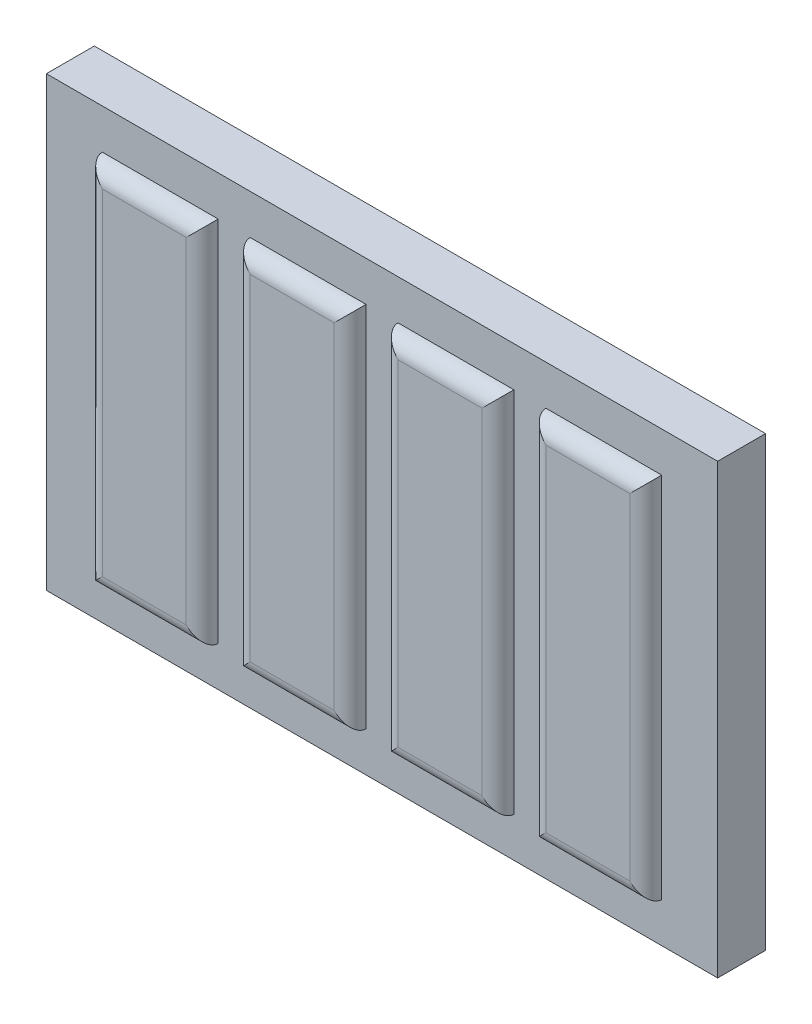
ISO-10303-21;
HEADER;
FILE_DESCRIPTION(('STEP AP214'),'2;1');
FILE_NAME('part.step','',(''),(''),'','','');
FILE_SCHEMA(('AUTOMOTIVE_DESIGN { 1 0 10303 214 1 1 1 1 }'));
ENDSEC;
DATA;
#1=APPLICATION_CONTEXT('core data for automotive mechanical design processes');
#2=APPLICATION_PROTOCOL_DEFINITION('international standard','automotive_design',2000,#1);
#3=PRODUCT_CONTEXT('',#1,'mechanical');
#4=PRODUCT('Part','Part','',(#3));
#5=PRODUCT_RELATED_PRODUCT_CATEGORY('part','',(#4));
#6=PRODUCT_DEFINITION_FORMATION('','',#4);
#7=PRODUCT_DEFINITION_CONTEXT('part definition',#1,'design');
#8=PRODUCT_DEFINITION('design','',#6,#7);
#9=PRODUCT_DEFINITION_SHAPE('','',#8);
#10=(LENGTH_UNIT() NAMED_UNIT(*) SI_UNIT(.MILLI.,.METRE.));
#11=(NAMED_UNIT(*) PLANE_ANGLE_UNIT() SI_UNIT($,.RADIAN.));
#12=(NAMED_UNIT(*) SI_UNIT($,.STERADIAN.) SOLID_ANGLE_UNIT());
#13=UNCERTAINTY_MEASURE_WITH_UNIT(LENGTH_MEASURE(1.E-05),#10,'distance_accuracy_value','');
#14=(GEOMETRIC_REPRESENTATION_CONTEXT(3) GLOBAL_UNCERTAINTY_ASSIGNED_CONTEXT((#13)) GLOBAL_UNIT_ASSIGNED_CONTEXT((#10,
#11,#12)) REPRESENTATION_CONTEXT('',''));
#15=CARTESIAN_POINT('',(0.,0.,0.));
#16=DIRECTION('',(0.,0.,1.));
#17=DIRECTION('',(1.,0.,0.));
#18=AXIS2_PLACEMENT_3D('',#15,#16,#17);
#19=CARTESIAN_POINT('',(0.,0.,0.762));
#20=DIRECTION('',(0.,0.,1.));
#21=DIRECTION('',(1.,0.,0.));
#22=AXIS2_PLACEMENT_3D('',#19,#20,#21);
#23=PLANE('',#22);
#24=DIRECTION('',(0.,-1.,0.));
#25=VECTOR('',#24,1.);
#26=CARTESIAN_POINT('',(0.,7.112,0.762));
#27=LINE('',#26,#25);
#28=CARTESIAN_POINT('',(0.,7.112,0.762));
#29=VERTEX_POINT('',#28);
#30=CARTESIAN_POINT('',(0.,0.,0.762));
#31=VERTEX_POINT('',#30);
#32=EDGE_CURVE('E259',#29,#31,#27,.T.);
#33=ORIENTED_EDGE('',*,*,#32,.T.);
#34=DIRECTION('',(1.,0.,0.));
#35=VECTOR('',#34,1.);
#36=CARTESIAN_POINT('',(0.,0.,0.762));
#37=LINE('',#36,#35);
#38=CARTESIAN_POINT('',(10.668,0.,0.762));
#39=VERTEX_POINT('',#38);
#40=EDGE_CURVE('E263',#31,#39,#37,.T.);
#41=ORIENTED_EDGE('',*,*,#40,.T.);
#42=DIRECTION('',(0.,1.,0.));
#43=VECTOR('',#42,1.);
#44=CARTESIAN_POINT('',(10.668,0.,0.762));
#45=LINE('',#44,#43);
#46=CARTESIAN_POINT('',(10.668,7.112,0.762));
#47=VERTEX_POINT('',#46);
#48=EDGE_CURVE('E267',#39,#47,#45,.T.);
#49=ORIENTED_EDGE('',*,*,#48,.T.);
#50=DIRECTION('',(-1.,0.,0.));
#51=VECTOR('',#50,1.);
#52=CARTESIAN_POINT('',(10.668,7.112,0.762));
#53=LINE('',#52,#51);
#54=EDGE_CURVE('E270',#47,#29,#53,.T.);
#55=ORIENTED_EDGE('',*,*,#54,.T.);
#56=EDGE_LOOP('',(#33,#41,#49,#55));
#57=FACE_BOUND('',#56,.T.);
#58=DIRECTION('',(0.,-1.,0.));
#59=VECTOR('',#58,1.);
#60=CARTESIAN_POINT('',(0.888999999999997,0.634999999999997,0.762));
#61=LINE('',#60,#59);
#62=CARTESIAN_POINT('',(0.888999999999997,6.477,0.762));
#63=VERTEX_POINT('',#62);
#64=CARTESIAN_POINT('',(0.888999999999997,0.634999999999997,0.762));
#65=VERTEX_POINT('',#64);
#66=EDGE_CURVE('E246',#63,#65,#61,.T.);
#67=ORIENTED_EDGE('',*,*,#66,.F.);
#68=DIRECTION('',(-1.,0.,0.));
#69=VECTOR('',#68,1.);
#70=CARTESIAN_POINT('',(0.888999999999997,6.477,0.762));
#71=LINE('',#70,#69);
#72=CARTESIAN_POINT('',(2.7305,6.477,0.762));
#73=VERTEX_POINT('',#72);
#74=EDGE_CURVE('E242',#73,#63,#71,.T.);
#75=ORIENTED_EDGE('',*,*,#74,.F.);
#76=DIRECTION('',(0.,1.,0.));
#77=VECTOR('',#76,1.);
#78=CARTESIAN_POINT('',(2.7305,6.477,0.762));
#79=LINE('',#78,#77);
#80=CARTESIAN_POINT('',(2.7305,0.634999999999998,0.762));
#81=VERTEX_POINT('',#80);
#82=EDGE_CURVE('E254',#81,#73,#79,.T.);
#83=ORIENTED_EDGE('',*,*,#82,.F.);
#84=DIRECTION('',(1.,0.,0.));
#85=VECTOR('',#84,1.);
#86=CARTESIAN_POINT('',(0.888999999999997,0.634999999999997,0.762));
#87=LINE('',#86,#85);
#88=EDGE_CURVE('E250',#65,#81,#87,.T.);
#89=ORIENTED_EDGE('',*,*,#88,.F.);
#90=EDGE_LOOP('',(#67,#75,#83,#89));
#91=FACE_BOUND('',#90,.T.);
#92=DIRECTION('',(0.,-1.,0.));
#93=VECTOR('',#92,1.);
#94=CARTESIAN_POINT('',(7.9375,6.477,0.762));
#95=LINE('',#94,#93);
#96=CARTESIAN_POINT('',(7.9375,6.477,0.762));
#97=VERTEX_POINT('',#96);
#98=CARTESIAN_POINT('',(7.9375,0.634999999999998,0.762));
#99=VERTEX_POINT('',#98);
#100=EDGE_CURVE('E230',#97,#99,#95,.T.);
#101=ORIENTED_EDGE('',*,*,#100,.F.);
#102=DIRECTION('',(-1.,0.,0.));
#103=VECTOR('',#102,1.);
#104=CARTESIAN_POINT('',(7.9375,6.477,0.762));
#105=LINE('',#104,#103);
#106=CARTESIAN_POINT('',(9.779,6.477,0.762));
#107=VERTEX_POINT('',#106);
#108=EDGE_CURVE('E226',#107,#97,#105,.T.);
#109=ORIENTED_EDGE('',*,*,#108,.F.);
#110=DIRECTION('',(0.,1.,0.));
#111=VECTOR('',#110,1.);
#112=CARTESIAN_POINT('',(9.779,6.477,0.762));
#113=LINE('',#112,#111);
#114=CARTESIAN_POINT('',(9.779,0.634999999999998,0.762));
#115=VERTEX_POINT('',#114);
#116=EDGE_CURVE('E238',#115,#107,#113,.T.);
#117=ORIENTED_EDGE('',*,*,#116,.F.);
#118=DIRECTION('',(1.,0.,0.));
#119=VECTOR('',#118,1.);
#120=CARTESIAN_POINT('',(7.9375,0.634999999999998,0.762));
#121=LINE('',#120,#119);
#122=EDGE_CURVE('E234',#99,#115,#121,.T.);
#123=ORIENTED_EDGE('',*,*,#122,.F.);
#124=EDGE_LOOP('',(#101,#109,#117,#123));
#125=FACE_BOUND('',#124,.T.);
#126=DIRECTION('',(0.,-1.,0.));
#127=VECTOR('',#126,1.);
#128=CARTESIAN_POINT('',(3.2385,6.477,0.762));
#129=LINE('',#128,#127);
#130=CARTESIAN_POINT('',(3.2385,6.477,0.762));
#131=VERTEX_POINT('',#130);
#132=CARTESIAN_POINT('',(3.2385,0.634999999999998,0.762));
#133=VERTEX_POINT('',#132);
#134=EDGE_CURVE('E214',#131,#133,#129,.T.);
#135=ORIENTED_EDGE('',*,*,#134,.F.);
#136=DIRECTION('',(-1.,0.,0.));
#137=VECTOR('',#136,1.);
#138=CARTESIAN_POINT('',(3.2385,6.477,0.762));
#139=LINE('',#138,#137);
#140=CARTESIAN_POINT('',(5.08,6.477,0.762));
#141=VERTEX_POINT('',#140);
#142=EDGE_CURVE('E210',#141,#131,#139,.T.);
#143=ORIENTED_EDGE('',*,*,#142,.F.);
#144=DIRECTION('',(0.,1.,0.));
#145=VECTOR('',#144,1.);
#146=CARTESIAN_POINT('',(5.08,6.477,0.762));
#147=LINE('',#146,#145);
#148=CARTESIAN_POINT('',(5.08,0.634999999999998,0.762));
#149=VERTEX_POINT('',#148);
#150=EDGE_CURVE('E222',#149,#141,#147,.T.);
#151=ORIENTED_EDGE('',*,*,#150,.F.);
#152=DIRECTION('',(1.,0.,0.));
#153=VECTOR('',#152,1.);
#154=CARTESIAN_POINT('',(3.2385,0.634999999999998,0.762));
#155=LINE('',#154,#153);
#156=EDGE_CURVE('E218',#133,#149,#155,.T.);
#157=ORIENTED_EDGE('',*,*,#156,.F.);
#158=EDGE_LOOP('',(#135,#143,#151,#157));
#159=FACE_BOUND('',#158,.T.);
#160=DIRECTION('',(0.,-1.,0.));
#161=VECTOR('',#160,1.);
#162=CARTESIAN_POINT('',(5.588,6.477,0.762));
#163=LINE('',#162,#161);
#164=CARTESIAN_POINT('',(5.588,6.477,0.762));
#165=VERTEX_POINT('',#164);
#166=CARTESIAN_POINT('',(5.588,0.634999999999998,0.762));
#167=VERTEX_POINT('',#166);
#168=EDGE_CURVE('E176',#165,#167,#163,.T.);
#169=ORIENTED_EDGE('',*,*,#168,.F.);
#170=DIRECTION('',(-1.,0.,0.));
#171=VECTOR('',#170,1.);
#172=CARTESIAN_POINT('',(5.588,6.477,0.762));
#173=LINE('',#172,#171);
#174=CARTESIAN_POINT('',(7.4295,6.477,0.762));
#175=VERTEX_POINT('',#174);
#176=EDGE_CURVE('E180',#175,#165,#173,.T.);
#177=ORIENTED_EDGE('',*,*,#176,.F.);
#178=DIRECTION('',(0.,1.,0.));
#179=VECTOR('',#178,1.);
#180=CARTESIAN_POINT('',(7.4295,6.477,0.762));
#181=LINE('',#180,#179);
#182=CARTESIAN_POINT('',(7.4295,0.634999999999998,0.762));
#183=VERTEX_POINT('',#182);
#184=EDGE_CURVE('E207',#183,#175,#181,.T.);
#185=ORIENTED_EDGE('',*,*,#184,.F.);
#186=DIRECTION('',(1.,0.,0.));
#187=VECTOR('',#186,1.);
#188=CARTESIAN_POINT('',(5.588,0.634999999999998,0.762));
#189=LINE('',#188,#187);
#190=EDGE_CURVE('E183',#167,#183,#189,.T.);
#191=ORIENTED_EDGE('',*,*,#190,.F.);
#192=EDGE_LOOP('',(#169,#177,#185,#191));
#193=FACE_BOUND('',#192,.T.);
#194=ADVANCED_FACE('F39',(#57,#91,#125,#159,#193),#23,.T.);
#195=CARTESIAN_POINT('',(0.,7.112,0.762));
#196=DIRECTION('',(1.,0.,0.));
#197=DIRECTION('',(0.,1.,0.));
#198=AXIS2_PLACEMENT_3D('',#195,#196,#197);
#199=PLANE('',#198);
#200=DIRECTION('',(0.,-1.,0.));
#201=VECTOR('',#200,1.);
#202=CARTESIAN_POINT('',(0.,7.112,0.));
#203=LINE('',#202,#201);
#204=CARTESIAN_POINT('',(0.,7.112,0.));
#205=VERTEX_POINT('',#204);
#206=CARTESIAN_POINT('',(0.,0.,0.));
#207=VERTEX_POINT('',#206);
#208=EDGE_CURVE('E258',#205,#207,#203,.T.);
#209=ORIENTED_EDGE('',*,*,#208,.T.);
#210=DIRECTION('',(0.,0.,-1.));
#211=VECTOR('',#210,1.);
#212=CARTESIAN_POINT('',(0.,0.,0.762));
#213=LINE('',#212,#211);
#214=EDGE_CURVE('E296',#31,#207,#213,.T.);
#215=ORIENTED_EDGE('',*,*,#214,.F.);
#216=ORIENTED_EDGE('',*,*,#32,.F.);
#217=DIRECTION('',(0.,0.,-1.));
#218=VECTOR('',#217,1.);
#219=CARTESIAN_POINT('',(0.,7.112,0.762));
#220=LINE('',#219,#218);
#221=EDGE_CURVE('E273',#29,#205,#220,.T.);
#222=ORIENTED_EDGE('',*,*,#221,.T.);
#223=EDGE_LOOP('',(#209,#215,#216,#222));
#224=FACE_BOUND('',#223,.T.);
#225=ADVANCED_FACE('F400',(#224),#199,.F.);
#226=CARTESIAN_POINT('',(0.,0.,0.762));
#227=DIRECTION('',(0.,1.,0.));
#228=DIRECTION('',(0.,0.,1.));
#229=AXIS2_PLACEMENT_3D('',#226,#227,#228);
#230=PLANE('',#229);
#231=DIRECTION('',(1.,0.,0.));
#232=VECTOR('',#231,1.);
#233=CARTESIAN_POINT('',(0.,0.,0.));
#234=LINE('',#233,#232);
#235=CARTESIAN_POINT('',(10.668,0.,0.));
#236=VERTEX_POINT('',#235);
#237=EDGE_CURVE('E277',#207,#236,#234,.T.);
#238=ORIENTED_EDGE('',*,*,#237,.T.);
#239=DIRECTION('',(0.,0.,-1.));
#240=VECTOR('',#239,1.);
#241=CARTESIAN_POINT('',(10.668,0.,0.762));
#242=LINE('',#241,#240);
#243=EDGE_CURVE('E292',#39,#236,#242,.T.);
#244=ORIENTED_EDGE('',*,*,#243,.F.);
#245=ORIENTED_EDGE('',*,*,#40,.F.);
#246=ORIENTED_EDGE('',*,*,#214,.T.);
#247=EDGE_LOOP('',(#238,#244,#245,#246));
#248=FACE_BOUND('',#247,.T.);
#249=ADVANCED_FACE('F406',(#248),#230,.F.);
#250=CARTESIAN_POINT('',(10.668,0.,0.762));
#251=DIRECTION('',(-1.,0.,0.));
#252=DIRECTION('',(0.,-1.,0.));
#253=AXIS2_PLACEMENT_3D('',#250,#251,#252);
#254=PLANE('',#253);
#255=DIRECTION('',(0.,1.,0.));
#256=VECTOR('',#255,1.);
#257=CARTESIAN_POINT('',(10.668,0.,0.));
#258=LINE('',#257,#256);
#259=CARTESIAN_POINT('',(10.668,7.112,0.));
#260=VERTEX_POINT('',#259);
#261=EDGE_CURVE('E280',#236,#260,#258,.T.);
#262=ORIENTED_EDGE('',*,*,#261,.T.);
#263=DIRECTION('',(0.,0.,-1.));
#264=VECTOR('',#263,1.);
#265=CARTESIAN_POINT('',(10.668,7.112,0.762));
#266=LINE('',#265,#264);
#267=EDGE_CURVE('E288',#47,#260,#266,.T.);
#268=ORIENTED_EDGE('',*,*,#267,.F.);
#269=ORIENTED_EDGE('',*,*,#48,.F.);
#270=ORIENTED_EDGE('',*,*,#243,.T.);
#271=EDGE_LOOP('',(#262,#268,#269,#270));
#272=FACE_BOUND('',#271,.T.);
#273=ADVANCED_FACE('F421',(#272),#254,.F.);
#274=CARTESIAN_POINT('',(10.668,7.112,0.762));
#275=DIRECTION('',(0.,-1.,0.));
#276=DIRECTION('',(1.,0.,0.));
#277=AXIS2_PLACEMENT_3D('',#274,#275,#276);
#278=PLANE('',#277);
#279=DIRECTION('',(-1.,0.,0.));
#280=VECTOR('',#279,1.);
#281=CARTESIAN_POINT('',(10.668,7.112,0.));
#282=LINE('',#281,#280);
#283=EDGE_CURVE('E264',#260,#205,#282,.T.);
#284=ORIENTED_EDGE('',*,*,#283,.T.);
#285=ORIENTED_EDGE('',*,*,#221,.F.);
#286=ORIENTED_EDGE('',*,*,#54,.F.);
#287=ORIENTED_EDGE('',*,*,#267,.T.);
#288=EDGE_LOOP('',(#284,#285,#286,#287));
#289=FACE_BOUND('',#288,.T.);
#290=ADVANCED_FACE('F417',(#289),#278,.F.);
#291=CARTESIAN_POINT('',(0.,0.,0.));
#292=DIRECTION('',(0.,0.,1.));
#293=DIRECTION('',(1.,0.,0.));
#294=AXIS2_PLACEMENT_3D('',#291,#292,#293);
#295=PLANE('',#294);
#296=ORIENTED_EDGE('',*,*,#208,.F.);
#297=ORIENTED_EDGE('',*,*,#283,.F.);
#298=ORIENTED_EDGE('',*,*,#261,.F.);
#299=ORIENTED_EDGE('',*,*,#237,.F.);
#300=EDGE_LOOP('',(#296,#297,#298,#299));
#301=FACE_BOUND('',#300,.T.);
#302=ADVANCED_FACE('F414',(#301),#295,.F.);
#303=CARTESIAN_POINT('',(0.,0.,1.016));
#304=DIRECTION('',(0.,0.,-1.));
#305=DIRECTION('',(-1.,0.,0.));
#306=AXIS2_PLACEMENT_3D('',#303,#304,#305);
#307=PLANE('',#306);
#308=DIRECTION('',(1.,0.,0.));
#309=VECTOR('',#308,1.);
#310=CARTESIAN_POINT('',(0.,0.888999999999997,1.016));
#311=LINE('',#310,#309);
#312=CARTESIAN_POINT('',(1.143,0.888999999999997,1.016));
#313=VERTEX_POINT('',#312);
#314=CARTESIAN_POINT('',(2.4765,0.888999999999998,1.016));
#315=VERTEX_POINT('',#314);
#316=EDGE_CURVE('E306',#313,#315,#311,.T.);
#317=ORIENTED_EDGE('',*,*,#316,.T.);
#318=DIRECTION('',(0.,1.,0.));
#319=VECTOR('',#318,1.);
#320=CARTESIAN_POINT('',(2.4765,0.,1.016));
#321=LINE('',#320,#319);
#322=CARTESIAN_POINT('',(2.4765,6.223,1.016));
#323=VERTEX_POINT('',#322);
#324=EDGE_CURVE('E309',#315,#323,#321,.T.);
#325=ORIENTED_EDGE('',*,*,#324,.T.);
#326=DIRECTION('',(-1.,0.,0.));
#327=VECTOR('',#326,1.);
#328=CARTESIAN_POINT('',(0.,6.223,1.016));
#329=LINE('',#328,#327);
#330=CARTESIAN_POINT('',(1.143,6.223,1.016));
#331=VERTEX_POINT('',#330);
#332=EDGE_CURVE('E300',#323,#331,#329,.T.);
#333=ORIENTED_EDGE('',*,*,#332,.T.);
#334=DIRECTION('',(0.,-1.,0.));
#335=VECTOR('',#334,1.);
#336=CARTESIAN_POINT('',(1.143,0.,1.016));
#337=LINE('',#336,#335);
#338=EDGE_CURVE('E303',#331,#313,#337,.T.);
#339=ORIENTED_EDGE('',*,*,#338,.T.);
#340=EDGE_LOOP('',(#317,#325,#333,#339));
#341=FACE_BOUND('',#340,.T.);
#342=ADVANCED_FACE('F412',(#341),#307,.F.);
#343=CARTESIAN_POINT('',(0.,0.,1.016));
#344=DIRECTION('',(0.,0.,-1.));
#345=DIRECTION('',(-1.,0.,0.));
#346=AXIS2_PLACEMENT_3D('',#343,#344,#345);
#347=PLANE('',#346);
#348=DIRECTION('',(1.,0.,0.));
#349=VECTOR('',#348,1.);
#350=CARTESIAN_POINT('',(0.,0.888999999999998,1.016));
#351=LINE('',#350,#349);
#352=CARTESIAN_POINT('',(8.1915,0.888999999999998,1.016));
#353=VERTEX_POINT('',#352);
#354=CARTESIAN_POINT('',(9.525,0.888999999999998,1.016));
#355=VERTEX_POINT('',#354);
#356=EDGE_CURVE('E332',#353,#355,#351,.T.);
#357=ORIENTED_EDGE('',*,*,#356,.T.);
#358=DIRECTION('',(0.,1.,0.));
#359=VECTOR('',#358,1.);
#360=CARTESIAN_POINT('',(9.525,0.,1.016));
#361=LINE('',#360,#359);
#362=CARTESIAN_POINT('',(9.525,6.223,1.016));
#363=VERTEX_POINT('',#362);
#364=EDGE_CURVE('E335',#355,#363,#361,.T.);
#365=ORIENTED_EDGE('',*,*,#364,.T.);
#366=DIRECTION('',(-1.,0.,0.));
#367=VECTOR('',#366,1.);
#368=CARTESIAN_POINT('',(0.,6.223,1.016));
#369=LINE('',#368,#367);
#370=CARTESIAN_POINT('',(8.1915,6.223,1.016));
#371=VERTEX_POINT('',#370);
#372=EDGE_CURVE('E326',#363,#371,#369,.T.);
#373=ORIENTED_EDGE('',*,*,#372,.T.);
#374=DIRECTION('',(0.,-1.,0.));
#375=VECTOR('',#374,1.);
#376=CARTESIAN_POINT('',(8.1915,0.,1.016));
#377=LINE('',#376,#375);
#378=EDGE_CURVE('E329',#371,#353,#377,.T.);
#379=ORIENTED_EDGE('',*,*,#378,.T.);
#380=EDGE_LOOP('',(#357,#365,#373,#379));
#381=FACE_BOUND('',#380,.T.);
#382=ADVANCED_FACE('F584',(#381),#347,.F.);
#383=CARTESIAN_POINT('',(0.,0.,1.016));
#384=DIRECTION('',(0.,0.,-1.));
#385=DIRECTION('',(-1.,0.,0.));
#386=AXIS2_PLACEMENT_3D('',#383,#384,#385);
#387=PLANE('',#386);
#388=DIRECTION('',(1.,0.,0.));
#389=VECTOR('',#388,1.);
#390=CARTESIAN_POINT('',(0.,0.888999999999998,1.016));
#391=LINE('',#390,#389);
#392=CARTESIAN_POINT('',(3.4925,0.888999999999998,1.016));
#393=VERTEX_POINT('',#392);
#394=CARTESIAN_POINT('',(4.826,0.888999999999998,1.016));
#395=VERTEX_POINT('',#394);
#396=EDGE_CURVE('E319',#393,#395,#391,.T.);
#397=ORIENTED_EDGE('',*,*,#396,.T.);
#398=DIRECTION('',(0.,1.,0.));
#399=VECTOR('',#398,1.);
#400=CARTESIAN_POINT('',(4.826,0.,1.016));
#401=LINE('',#400,#399);
#402=CARTESIAN_POINT('',(4.826,6.223,1.016));
#403=VERTEX_POINT('',#402);
#404=EDGE_CURVE('E322',#395,#403,#401,.T.);
#405=ORIENTED_EDGE('',*,*,#404,.T.);
#406=DIRECTION('',(-1.,0.,0.));
#407=VECTOR('',#406,1.);
#408=CARTESIAN_POINT('',(0.,6.223,1.016));
#409=LINE('',#408,#407);
#410=CARTESIAN_POINT('',(3.4925,6.223,1.016));
#411=VERTEX_POINT('',#410);
#412=EDGE_CURVE('E313',#403,#411,#409,.T.);
#413=ORIENTED_EDGE('',*,*,#412,.T.);
#414=DIRECTION('',(0.,-1.,0.));
#415=VECTOR('',#414,1.);
#416=CARTESIAN_POINT('',(3.4925,0.,1.016));
#417=LINE('',#416,#415);
#418=EDGE_CURVE('E316',#411,#393,#417,.T.);
#419=ORIENTED_EDGE('',*,*,#418,.T.);
#420=EDGE_LOOP('',(#397,#405,#413,#419));
#421=FACE_BOUND('',#420,.T.);
#422=ADVANCED_FACE('F575',(#421),#387,.F.);
#423=CARTESIAN_POINT('',(0.,0.,1.016));
#424=DIRECTION('',(0.,0.,-1.));
#425=DIRECTION('',(-1.,0.,0.));
#426=AXIS2_PLACEMENT_3D('',#423,#424,#425);
#427=PLANE('',#426);
#428=DIRECTION('',(1.,0.,0.));
#429=VECTOR('',#428,1.);
#430=CARTESIAN_POINT('',(0.,0.888999999999998,1.016));
#431=LINE('',#430,#429);
#432=CARTESIAN_POINT('',(5.842,0.888999999999998,1.016));
#433=VERTEX_POINT('',#432);
#434=CARTESIAN_POINT('',(7.1755,0.888999999999998,1.016));
#435=VERTEX_POINT('',#434);
#436=EDGE_CURVE('E49',#433,#435,#431,.T.);
#437=ORIENTED_EDGE('',*,*,#436,.T.);
#438=DIRECTION('',(0.,1.,0.));
#439=VECTOR('',#438,1.);
#440=CARTESIAN_POINT('',(7.1755,0.,1.016));
#441=LINE('',#440,#439);
#442=CARTESIAN_POINT('',(7.1755,6.223,1.016));
#443=VERTEX_POINT('',#442);
#444=EDGE_CURVE('E11',#435,#443,#441,.T.);
#445=ORIENTED_EDGE('',*,*,#444,.T.);
#446=DIRECTION('',(-1.,0.,0.));
#447=VECTOR('',#446,1.);
#448=CARTESIAN_POINT('',(0.,6.223,1.016));
#449=LINE('',#448,#447);
#450=CARTESIAN_POINT('',(5.842,6.223,1.016));
#451=VERTEX_POINT('',#450);
#452=EDGE_CURVE('E339',#443,#451,#449,.T.);
#453=ORIENTED_EDGE('',*,*,#452,.T.);
#454=DIRECTION('',(0.,-1.,0.));
#455=VECTOR('',#454,1.);
#456=CARTESIAN_POINT('',(5.842,0.,1.016));
#457=LINE('',#456,#455);
#458=EDGE_CURVE('E60',#451,#433,#457,.T.);
#459=ORIENTED_EDGE('',*,*,#458,.T.);
#460=EDGE_LOOP('',(#437,#445,#453,#459));
#461=FACE_BOUND('',#460,.T.);
#462=ADVANCED_FACE('F445',(#461),#427,.F.);
#463=CARTESIAN_POINT('',(1.143,0.,0.762));
#464=DIRECTION('',(0.,-1.,0.));
#465=DIRECTION('',(0.,0.,-1.));
#466=AXIS2_PLACEMENT_3D('',#463,#464,#465);
#467=CYLINDRICAL_SURFACE('',#466,0.254);
#468=CARTESIAN_POINT('',(1.143,6.223,0.762));
#469=DIRECTION('',(-0.707106781186547,-0.707106781186547,0.));
#470=DIRECTION('',(-0.707106781186547,0.707106781186547,0.));
#471=AXIS2_PLACEMENT_3D('',#468,#469,#470);
#472=ELLIPSE('',#471,0.359210244842766,0.254);
#473=EDGE_CURVE('E202',#63,#331,#472,.F.);
#474=ORIENTED_EDGE('',*,*,#473,.F.);
#475=ORIENTED_EDGE('',*,*,#66,.T.);
#476=CARTESIAN_POINT('',(1.143,0.888999999999997,0.762));
#477=DIRECTION('',(0.707106781186548,-0.707106781186547,0.));
#478=DIRECTION('',(-0.707106781186547,-0.707106781186548,0.));
#479=AXIS2_PLACEMENT_3D('',#476,#477,#478);
#480=ELLIPSE('',#479,0.359210244842766,0.254);
#481=EDGE_CURVE('E198',#313,#65,#480,.T.);
#482=ORIENTED_EDGE('',*,*,#481,.F.);
#483=ORIENTED_EDGE('',*,*,#338,.F.);
#484=EDGE_LOOP('',(#474,#475,#482,#483));
#485=FACE_BOUND('',#484,.T.);
#486=ADVANCED_FACE('F441',(#485),#467,.T.);
#487=CARTESIAN_POINT('',(0.,0.888999999999997,0.762));
#488=DIRECTION('',(1.,0.,0.));
#489=DIRECTION('',(0.,1.,0.));
#490=AXIS2_PLACEMENT_3D('',#487,#488,#489);
#491=CYLINDRICAL_SURFACE('',#490,0.254);
#492=ORIENTED_EDGE('',*,*,#481,.T.);
#493=ORIENTED_EDGE('',*,*,#88,.T.);
#494=CARTESIAN_POINT('',(2.4765,0.888999999999998,0.762));
#495=DIRECTION('',(0.707106781186547,0.707106781186548,0.));
#496=DIRECTION('',(0.707106781186548,-0.707106781186547,0.));
#497=AXIS2_PLACEMENT_3D('',#494,#495,#496);
#498=ELLIPSE('',#497,0.359210244842766,0.254);
#499=EDGE_CURVE('E349',#315,#81,#498,.T.);
#500=ORIENTED_EDGE('',*,*,#499,.F.);
#501=ORIENTED_EDGE('',*,*,#316,.F.);
#502=EDGE_LOOP('',(#492,#493,#500,#501));
#503=FACE_BOUND('',#502,.T.);
#504=ADVANCED_FACE('F437',(#503),#491,.T.);
#505=CARTESIAN_POINT('',(0.,6.223,0.762));
#506=DIRECTION('',(-1.,0.,0.));
#507=DIRECTION('',(0.,0.,1.));
#508=AXIS2_PLACEMENT_3D('',#505,#506,#507);
#509=CYLINDRICAL_SURFACE('',#508,0.254);
#510=ORIENTED_EDGE('',*,*,#473,.T.);
#511=ORIENTED_EDGE('',*,*,#332,.F.);
#512=CARTESIAN_POINT('',(2.4765,6.223,0.762));
#513=DIRECTION('',(-0.707106781186548,0.707106781186547,0.));
#514=DIRECTION('',(-0.707106781186547,-0.707106781186548,0.));
#515=AXIS2_PLACEMENT_3D('',#512,#513,#514);
#516=ELLIPSE('',#515,0.359210244842766,0.254);
#517=EDGE_CURVE('E346',#73,#323,#516,.F.);
#518=ORIENTED_EDGE('',*,*,#517,.F.);
#519=ORIENTED_EDGE('',*,*,#74,.T.);
#520=EDGE_LOOP('',(#510,#511,#518,#519));
#521=FACE_BOUND('',#520,.T.);
#522=ADVANCED_FACE('F433',(#521),#509,.T.);
#523=CARTESIAN_POINT('',(2.4765,0.,0.762));
#524=DIRECTION('',(0.,1.,0.));
#525=DIRECTION('',(-1.,0.,0.));
#526=AXIS2_PLACEMENT_3D('',#523,#524,#525);
#527=CYLINDRICAL_SURFACE('',#526,0.254);
#528=ORIENTED_EDGE('',*,*,#499,.T.);
#529=ORIENTED_EDGE('',*,*,#82,.T.);
#530=ORIENTED_EDGE('',*,*,#517,.T.);
#531=ORIENTED_EDGE('',*,*,#324,.F.);
#532=EDGE_LOOP('',(#528,#529,#530,#531));
#533=FACE_BOUND('',#532,.T.);
#534=ADVANCED_FACE('F429',(#533),#527,.T.);
#535=CARTESIAN_POINT('',(3.4925,0.,0.762));
#536=DIRECTION('',(0.,-1.,0.));
#537=DIRECTION('',(1.,0.,0.));
#538=AXIS2_PLACEMENT_3D('',#535,#536,#537);
#539=CYLINDRICAL_SURFACE('',#538,0.254);
#540=CARTESIAN_POINT('',(3.4925,6.223,0.762));
#541=DIRECTION('',(-0.707106781186547,-0.707106781186548,0.));
#542=DIRECTION('',(-0.707106781186548,0.707106781186547,0.));
#543=AXIS2_PLACEMENT_3D('',#540,#541,#542);
#544=ELLIPSE('',#543,0.359210244842766,0.254);
#545=EDGE_CURVE('E363',#131,#411,#544,.F.);
#546=ORIENTED_EDGE('',*,*,#545,.F.);
#547=ORIENTED_EDGE('',*,*,#134,.T.);
#548=CARTESIAN_POINT('',(3.4925,0.888999999999998,0.762));
#549=DIRECTION('',(0.707106781186548,-0.707106781186547,0.));
#550=DIRECTION('',(-0.707106781186547,-0.707106781186548,0.));
#551=AXIS2_PLACEMENT_3D('',#548,#549,#550);
#552=ELLIPSE('',#551,0.359210244842766,0.254);
#553=EDGE_CURVE('E350',#393,#133,#552,.T.);
#554=ORIENTED_EDGE('',*,*,#553,.F.);
#555=ORIENTED_EDGE('',*,*,#418,.F.);
#556=EDGE_LOOP('',(#546,#547,#554,#555));
#557=FACE_BOUND('',#556,.T.);
#558=ADVANCED_FACE('F432',(#557),#539,.T.);
#559=CARTESIAN_POINT('',(0.,0.888999999999998,0.762));
#560=DIRECTION('',(1.,0.,0.));
#561=DIRECTION('',(0.,0.,-1.));
#562=AXIS2_PLACEMENT_3D('',#559,#560,#561);
#563=CYLINDRICAL_SURFACE('',#562,0.254);
#564=ORIENTED_EDGE('',*,*,#553,.T.);
#565=ORIENTED_EDGE('',*,*,#156,.T.);
#566=CARTESIAN_POINT('',(4.826,0.888999999999998,0.762));
#567=DIRECTION('',(0.707106781186547,0.707106781186547,0.));
#568=DIRECTION('',(0.707106781186547,-0.707106781186547,0.));
#569=AXIS2_PLACEMENT_3D('',#566,#567,#568);
#570=ELLIPSE('',#569,0.359210244842766,0.254);
#571=EDGE_CURVE('E359',#395,#149,#570,.T.);
#572=ORIENTED_EDGE('',*,*,#571,.F.);
#573=ORIENTED_EDGE('',*,*,#396,.F.);
#574=EDGE_LOOP('',(#564,#565,#572,#573));
#575=FACE_BOUND('',#574,.T.);
#576=ADVANCED_FACE('F455',(#575),#563,.T.);
#577=CARTESIAN_POINT('',(0.,6.223,0.762));
#578=DIRECTION('',(-1.,0.,0.));
#579=DIRECTION('',(0.,0.,1.));
#580=AXIS2_PLACEMENT_3D('',#577,#578,#579);
#581=CYLINDRICAL_SURFACE('',#580,0.254);
#582=ORIENTED_EDGE('',*,*,#545,.T.);
#583=ORIENTED_EDGE('',*,*,#412,.F.);
#584=CARTESIAN_POINT('',(4.826,6.223,0.762));
#585=DIRECTION('',(-0.707106781186547,0.707106781186547,0.));
#586=DIRECTION('',(-0.707106781186547,-0.707106781186547,0.));
#587=AXIS2_PLACEMENT_3D('',#584,#585,#586);
#588=ELLIPSE('',#587,0.359210244842766,0.254);
#589=EDGE_CURVE('E356',#141,#403,#588,.F.);
#590=ORIENTED_EDGE('',*,*,#589,.F.);
#591=ORIENTED_EDGE('',*,*,#142,.T.);
#592=EDGE_LOOP('',(#582,#583,#590,#591));
#593=FACE_BOUND('',#592,.T.);
#594=ADVANCED_FACE('F451',(#593),#581,.T.);
#595=CARTESIAN_POINT('',(4.826,0.,0.762));
#596=DIRECTION('',(0.,1.,0.));
#597=DIRECTION('',(0.,0.,1.));
#598=AXIS2_PLACEMENT_3D('',#595,#596,#597);
#599=CYLINDRICAL_SURFACE('',#598,0.254);
#600=ORIENTED_EDGE('',*,*,#571,.T.);
#601=ORIENTED_EDGE('',*,*,#150,.T.);
#602=ORIENTED_EDGE('',*,*,#589,.T.);
#603=ORIENTED_EDGE('',*,*,#404,.F.);
#604=EDGE_LOOP('',(#600,#601,#602,#603));
#605=FACE_BOUND('',#604,.T.);
#606=ADVANCED_FACE('F447',(#605),#599,.T.);
#607=CARTESIAN_POINT('',(8.1915,0.,0.762));
#608=DIRECTION('',(0.,-1.,0.));
#609=DIRECTION('',(0.,0.,-1.));
#610=AXIS2_PLACEMENT_3D('',#607,#608,#609);
#611=CYLINDRICAL_SURFACE('',#610,0.254);
#612=CARTESIAN_POINT('',(8.1915,6.223,0.762));
#613=DIRECTION('',(-0.707106781186548,-0.707106781186547,0.));
#614=DIRECTION('',(-0.707106781186547,0.707106781186548,0.));
#615=AXIS2_PLACEMENT_3D('',#612,#613,#614);
#616=ELLIPSE('',#615,0.359210244842766,0.254);
#617=EDGE_CURVE('E376',#97,#371,#616,.F.);
#618=ORIENTED_EDGE('',*,*,#617,.F.);
#619=ORIENTED_EDGE('',*,*,#100,.T.);
#620=CARTESIAN_POINT('',(8.1915,0.888999999999998,0.762));
#621=DIRECTION('',(0.707106781186547,-0.707106781186547,0.));
#622=DIRECTION('',(-0.707106781186547,-0.707106781186547,0.));
#623=AXIS2_PLACEMENT_3D('',#620,#621,#622);
#624=ELLIPSE('',#623,0.359210244842766,0.254);
#625=EDGE_CURVE('E360',#353,#99,#624,.T.);
#626=ORIENTED_EDGE('',*,*,#625,.F.);
#627=ORIENTED_EDGE('',*,*,#378,.F.);
#628=EDGE_LOOP('',(#618,#619,#626,#627));
#629=FACE_BOUND('',#628,.T.);
#630=ADVANCED_FACE('F450',(#629),#611,.T.);
#631=CARTESIAN_POINT('',(0.,0.888999999999998,0.762));
#632=DIRECTION('',(1.,0.,0.));
#633=DIRECTION('',(0.,0.,-1.));
#634=AXIS2_PLACEMENT_3D('',#631,#632,#633);
#635=CYLINDRICAL_SURFACE('',#634,0.254);
#636=ORIENTED_EDGE('',*,*,#625,.T.);
#637=ORIENTED_EDGE('',*,*,#122,.T.);
#638=CARTESIAN_POINT('',(9.525,0.888999999999998,0.762));
#639=DIRECTION('',(0.707106781186547,0.707106781186548,0.));
#640=DIRECTION('',(0.707106781186548,-0.707106781186547,0.));
#641=AXIS2_PLACEMENT_3D('',#638,#639,#640);
#642=ELLIPSE('',#641,0.359210244842766,0.254);
#643=EDGE_CURVE('E373',#355,#115,#642,.T.);
#644=ORIENTED_EDGE('',*,*,#643,.F.);
#645=ORIENTED_EDGE('',*,*,#356,.F.);
#646=EDGE_LOOP('',(#636,#637,#644,#645));
#647=FACE_BOUND('',#646,.T.);
#648=ADVANCED_FACE('F469',(#647),#635,.T.);
#649=CARTESIAN_POINT('',(0.,6.223,0.762));
#650=DIRECTION('',(-1.,0.,0.));
#651=DIRECTION('',(0.,-1.,0.));
#652=AXIS2_PLACEMENT_3D('',#649,#650,#651);
#653=CYLINDRICAL_SURFACE('',#652,0.254);
#654=ORIENTED_EDGE('',*,*,#617,.T.);
#655=ORIENTED_EDGE('',*,*,#372,.F.);
#656=CARTESIAN_POINT('',(9.525,6.223,0.762));
#657=DIRECTION('',(-0.707106781186547,0.707106781186548,0.));
#658=DIRECTION('',(-0.707106781186548,-0.707106781186547,0.));
#659=AXIS2_PLACEMENT_3D('',#656,#657,#658);
#660=ELLIPSE('',#659,0.359210244842766,0.254);
#661=EDGE_CURVE('E370',#107,#363,#660,.F.);
#662=ORIENTED_EDGE('',*,*,#661,.F.);
#663=ORIENTED_EDGE('',*,*,#108,.T.);
#664=EDGE_LOOP('',(#654,#655,#662,#663));
#665=FACE_BOUND('',#664,.T.);
#666=ADVANCED_FACE('F465',(#665),#653,.T.);
#667=CARTESIAN_POINT('',(9.525,0.,0.762));
#668=DIRECTION('',(0.,1.,0.));
#669=DIRECTION('',(-1.,0.,0.));
#670=AXIS2_PLACEMENT_3D('',#667,#668,#669);
#671=CYLINDRICAL_SURFACE('',#670,0.254);
#672=ORIENTED_EDGE('',*,*,#643,.T.);
#673=ORIENTED_EDGE('',*,*,#116,.T.);
#674=ORIENTED_EDGE('',*,*,#661,.T.);
#675=ORIENTED_EDGE('',*,*,#364,.F.);
#676=EDGE_LOOP('',(#672,#673,#674,#675));
#677=FACE_BOUND('',#676,.T.);
#678=ADVANCED_FACE('F398',(#677),#671,.T.);
#679=CARTESIAN_POINT('',(5.842,0.,0.762));
#680=DIRECTION('',(0.,-1.,0.));
#681=DIRECTION('',(1.,0.,0.));
#682=AXIS2_PLACEMENT_3D('',#679,#680,#681);
#683=CYLINDRICAL_SURFACE('',#682,0.254);
#684=CARTESIAN_POINT('',(5.842,6.223,0.762));
#685=DIRECTION('',(-0.707106781186547,-0.707106781186548,0.));
#686=DIRECTION('',(-0.707106781186548,0.707106781186547,0.));
#687=AXIS2_PLACEMENT_3D('',#684,#685,#686);
#688=ELLIPSE('',#687,0.359210244842766,0.254);
#689=EDGE_CURVE('E189',#165,#451,#688,.F.);
#690=ORIENTED_EDGE('',*,*,#689,.F.);
#691=ORIENTED_EDGE('',*,*,#168,.T.);
#692=CARTESIAN_POINT('',(5.842,0.888999999999998,0.762));
#693=DIRECTION('',(0.707106781186548,-0.707106781186547,0.));
#694=DIRECTION('',(-0.707106781186547,-0.707106781186547,0.));
#695=AXIS2_PLACEMENT_3D('',#692,#693,#694);
#696=ELLIPSE('',#695,0.359210244842766,0.254);
#697=EDGE_CURVE('E43',#433,#167,#696,.T.);
#698=ORIENTED_EDGE('',*,*,#697,.F.);
#699=ORIENTED_EDGE('',*,*,#458,.F.);
#700=EDGE_LOOP('',(#690,#691,#698,#699));
#701=FACE_BOUND('',#700,.T.);
#702=ADVANCED_FACE('F41',(#701),#683,.T.);
#703=CARTESIAN_POINT('',(0.,0.888999999999998,0.762));
#704=DIRECTION('',(1.,0.,0.));
#705=DIRECTION('',(0.,1.,0.));
#706=AXIS2_PLACEMENT_3D('',#703,#704,#705);
#707=CYLINDRICAL_SURFACE('',#706,0.254);
#708=ORIENTED_EDGE('',*,*,#697,.T.);
#709=ORIENTED_EDGE('',*,*,#190,.T.);
#710=CARTESIAN_POINT('',(7.1755,0.888999999999998,0.762));
#711=DIRECTION('',(0.707106781186547,0.707106781186547,0.));
#712=DIRECTION('',(0.707106781186548,-0.707106781186547,0.));
#713=AXIS2_PLACEMENT_3D('',#710,#711,#712);
#714=ELLIPSE('',#713,0.359210244842766,0.254);
#715=EDGE_CURVE('E193',#435,#183,#714,.T.);
#716=ORIENTED_EDGE('',*,*,#715,.F.);
#717=ORIENTED_EDGE('',*,*,#436,.F.);
#718=EDGE_LOOP('',(#708,#709,#716,#717));
#719=FACE_BOUND('',#718,.T.);
#720=ADVANCED_FACE('F390',(#719),#707,.T.);
#721=CARTESIAN_POINT('',(0.,6.223,0.762));
#722=DIRECTION('',(-1.,0.,0.));
#723=DIRECTION('',(0.,0.,1.));
#724=AXIS2_PLACEMENT_3D('',#721,#722,#723);
#725=CYLINDRICAL_SURFACE('',#724,0.254);
#726=ORIENTED_EDGE('',*,*,#689,.T.);
#727=ORIENTED_EDGE('',*,*,#452,.F.);
#728=CARTESIAN_POINT('',(7.1755,6.223,0.762));
#729=DIRECTION('',(-0.707106781186548,0.707106781186547,0.));
#730=DIRECTION('',(-0.707106781186547,-0.707106781186548,0.));
#731=AXIS2_PLACEMENT_3D('',#728,#729,#730);
#732=ELLIPSE('',#731,0.359210244842766,0.254);
#733=EDGE_CURVE('E196',#175,#443,#732,.F.);
#734=ORIENTED_EDGE('',*,*,#733,.F.);
#735=ORIENTED_EDGE('',*,*,#176,.T.);
#736=EDGE_LOOP('',(#726,#727,#734,#735));
#737=FACE_BOUND('',#736,.T.);
#738=ADVANCED_FACE('F195',(#737),#725,.T.);
#739=CARTESIAN_POINT('',(7.1755,0.,0.762));
#740=DIRECTION('',(0.,1.,0.));
#741=DIRECTION('',(-1.,0.,0.));
#742=AXIS2_PLACEMENT_3D('',#739,#740,#741);
#743=CYLINDRICAL_SURFACE('',#742,0.254);
#744=ORIENTED_EDGE('',*,*,#715,.T.);
#745=ORIENTED_EDGE('',*,*,#184,.T.);
#746=ORIENTED_EDGE('',*,*,#733,.T.);
#747=ORIENTED_EDGE('',*,*,#444,.F.);
#748=EDGE_LOOP('',(#744,#745,#746,#747));
#749=FACE_BOUND('',#748,.T.);
#750=ADVANCED_FACE('F388',(#749),#743,.T.);
#751=CLOSED_SHELL('',(#194,#225,#249,#273,#290,#302,#342,#382,#422,#462,#486,#504,#522,#534,
#558,#576,#594,#606,#630,#648,#666,#678,#702,#720,#738,#750));
#752=MANIFOLD_SOLID_BREP('B2',#751);
#753=ADVANCED_BREP_SHAPE_REPRESENTATION('',(#18,#752),#14);
#754=SHAPE_DEFINITION_REPRESENTATION(#9,#753);
ENDSEC;
END-ISO-10303-21;
